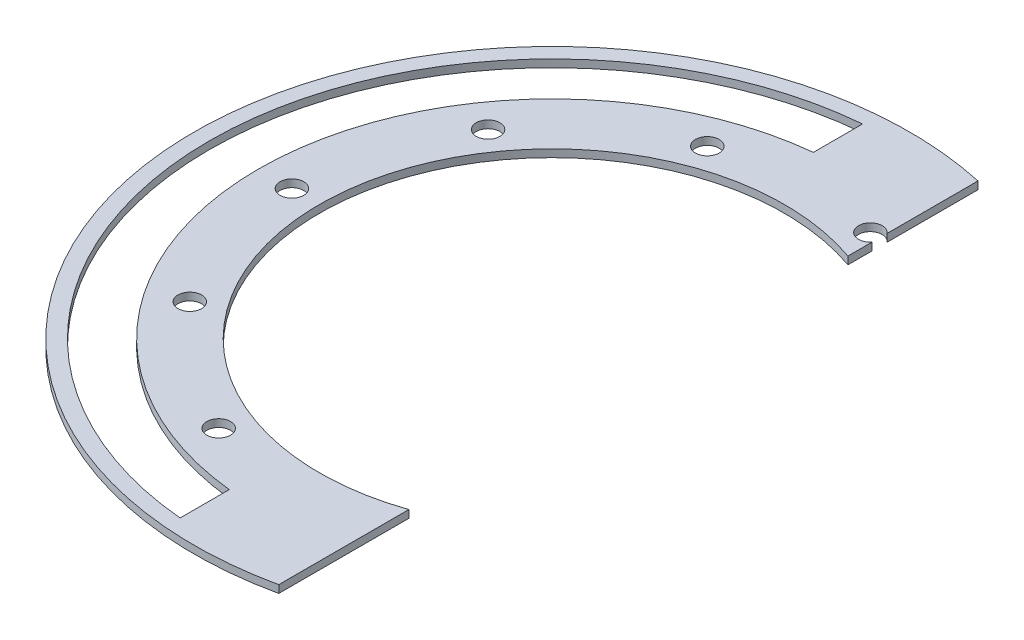
ISO-10303-21;
HEADER;
FILE_DESCRIPTION(('STEP AP214'),'2;1');
FILE_NAME('part.step','',(''),(''),'','','');
FILE_SCHEMA(('AUTOMOTIVE_DESIGN { 1 0 10303 214 1 1 1 1 }'));
ENDSEC;
DATA;
#1=APPLICATION_CONTEXT('core data for automotive mechanical design processes');
#2=APPLICATION_PROTOCOL_DEFINITION('international standard','automotive_design',2000,#1);
#3=PRODUCT_CONTEXT('',#1,'mechanical');
#4=PRODUCT('Part','Part','',(#3));
#5=PRODUCT_RELATED_PRODUCT_CATEGORY('part','',(#4));
#6=PRODUCT_DEFINITION_FORMATION('','',#4);
#7=PRODUCT_DEFINITION_CONTEXT('part definition',#1,'design');
#8=PRODUCT_DEFINITION('design','',#6,#7);
#9=PRODUCT_DEFINITION_SHAPE('','',#8);
#10=(LENGTH_UNIT() NAMED_UNIT(*) SI_UNIT(.MILLI.,.METRE.));
#11=(NAMED_UNIT(*) PLANE_ANGLE_UNIT() SI_UNIT($,.RADIAN.));
#12=(NAMED_UNIT(*) SI_UNIT($,.STERADIAN.) SOLID_ANGLE_UNIT());
#13=UNCERTAINTY_MEASURE_WITH_UNIT(LENGTH_MEASURE(1.E-05),#10,'distance_accuracy_value','');
#14=(GEOMETRIC_REPRESENTATION_CONTEXT(3) GLOBAL_UNCERTAINTY_ASSIGNED_CONTEXT((#13)) GLOBAL_UNIT_ASSIGNED_CONTEXT((#10,
#11,#12)) REPRESENTATION_CONTEXT('',''));
#15=CARTESIAN_POINT('',(0.,0.,0.));
#16=DIRECTION('',(0.,0.,1.));
#17=DIRECTION('',(1.,0.,0.));
#18=AXIS2_PLACEMENT_3D('',#15,#16,#17);
#19=CARTESIAN_POINT('',(15.8750000000001,-1.74625,0.));
#20=DIRECTION('',(-1.,0.,0.));
#21=DIRECTION('',(0.,0.,1.));
#22=AXIS2_PLACEMENT_3D('',#19,#20,#21);
#23=PLANE('',#22);
#24=DIRECTION('',(0.,0.,1.));
#25=VECTOR('',#24,1.);
#26=CARTESIAN_POINT('',(15.8750000000002,-0.79375,152.4));
#27=LINE('',#26,#25);
#28=CARTESIAN_POINT('',(15.875,-0.79375,-50.5837146273416));
#29=VERTEX_POINT('',#28);
#30=CARTESIAN_POINT('',(15.875,-0.79375,-45.5742468396352));
#31=VERTEX_POINT('',#30);
#32=EDGE_CURVE('E130',#29,#31,#27,.T.);
#33=ORIENTED_EDGE('',*,*,#32,.F.);
#34=DIRECTION('',(0.,1.,0.));
#35=VECTOR('',#34,1.);
#36=CARTESIAN_POINT('',(15.875,0.79375,-50.5837146273415));
#37=LINE('',#36,#35);
#38=CARTESIAN_POINT('',(15.875,0.793750000000001,-50.5837146273416));
#39=VERTEX_POINT('',#38);
#40=EDGE_CURVE('E124',#29,#39,#37,.T.);
#41=ORIENTED_EDGE('',*,*,#40,.T.);
#42=DIRECTION('',(0.,0.,1.));
#43=VECTOR('',#42,1.);
#44=CARTESIAN_POINT('',(15.8750000000001,0.79375,0.));
#45=LINE('',#44,#43);
#46=CARTESIAN_POINT('',(15.875,0.79375,-45.5742468396352));
#47=VERTEX_POINT('',#46);
#48=EDGE_CURVE('E236',#39,#47,#45,.T.);
#49=ORIENTED_EDGE('',*,*,#48,.T.);
#50=DIRECTION('',(0.,1.,0.));
#51=VECTOR('',#50,1.);
#52=CARTESIAN_POINT('',(15.875,-1.74625,-45.5742468396352));
#53=LINE('',#52,#51);
#54=EDGE_CURVE('E227',#31,#47,#53,.T.);
#55=ORIENTED_EDGE('',*,*,#54,.F.);
#56=EDGE_LOOP('',(#33,#41,#49,#55));
#57=FACE_BOUND('',#56,.T.);
#58=ADVANCED_FACE('F108',(#57),#23,.F.);
#59=CARTESIAN_POINT('',(152.4,0.79375,152.4));
#60=DIRECTION('',(0.,-1.,0.));
#61=DIRECTION('',(0.,0.,-1.));
#62=AXIS2_PLACEMENT_3D('',#59,#60,#61);
#63=PLANE('',#62);
#64=CARTESIAN_POINT('',(-18.4605372360028,0.793750000000001,50.7199092069195));
#65=DIRECTION('',(0.,1.,0.));
#66=DIRECTION('',(0.,0.,1.));
#67=AXIS2_PLACEMENT_3D('',#64,#65,#66);
#68=CIRCLE('',#67,2.45744999999999);
#69=CARTESIAN_POINT('',(-18.4605372360028,0.793750000000001,53.1773592069194));
#70=VERTEX_POINT('',#69);
#71=EDGE_CURVE('E452',#70,#70,#68,.T.);
#72=ORIENTED_EDGE('',*,*,#71,.F.);
#73=EDGE_LOOP('',(#72));
#74=FACE_BOUND('',#73,.T.);
#75=CARTESIAN_POINT('',(-44.2137315904983,0.793750000000001,30.9587881520478));
#76=DIRECTION('',(0.,1.,0.));
#77=DIRECTION('',(0.,0.,1.));
#78=AXIS2_PLACEMENT_3D('',#75,#76,#77);
#79=CIRCLE('',#78,2.45744999999999);
#80=CARTESIAN_POINT('',(-44.2137315904983,0.793750000000001,33.4162381520478));
#81=VERTEX_POINT('',#80);
#82=EDGE_CURVE('E454',#81,#81,#79,.T.);
#83=ORIENTED_EDGE('',*,*,#82,.F.);
#84=EDGE_LOOP('',(#83));
#85=FACE_BOUND('',#84,.T.);
#86=CARTESIAN_POINT('',(-18.4605372360028,0.793750000000001,-50.7199092069195));
#87=DIRECTION('',(0.,1.,0.));
#88=DIRECTION('',(0.,0.,1.));
#89=AXIS2_PLACEMENT_3D('',#86,#87,#88);
#90=CIRCLE('',#89,2.45744999999999);
#91=CARTESIAN_POINT('',(-18.4605372360028,0.793750000000001,-48.2624592069195));
#92=VERTEX_POINT('',#91);
#93=EDGE_CURVE('E464',#92,#92,#90,.T.);
#94=ORIENTED_EDGE('',*,*,#93,.F.);
#95=EDGE_LOOP('',(#94));
#96=FACE_BOUND('',#95,.T.);
#97=CARTESIAN_POINT('',(-44.2137315904983,0.793750000000001,-30.9587881520478));
#98=DIRECTION('',(0.,1.,0.));
#99=DIRECTION('',(0.,0.,1.));
#100=AXIS2_PLACEMENT_3D('',#97,#98,#99);
#101=CIRCLE('',#100,2.45744999999999);
#102=CARTESIAN_POINT('',(-44.2137315904983,0.793750000000001,-28.5013381520478));
#103=VERTEX_POINT('',#102);
#104=EDGE_CURVE('E470',#103,#103,#101,.T.);
#105=ORIENTED_EDGE('',*,*,#104,.F.);
#106=EDGE_LOOP('',(#105));
#107=FACE_BOUND('',#106,.T.);
#108=CARTESIAN_POINT('',(-53.975,0.793750000000001,0.));
#109=DIRECTION('',(0.,1.,0.));
#110=DIRECTION('',(0.,0.,1.));
#111=AXIS2_PLACEMENT_3D('',#108,#109,#110);
#112=CIRCLE('',#111,2.45744999999999);
#113=CARTESIAN_POINT('',(-53.975,0.793750000000001,2.45744999999998));
#114=VERTEX_POINT('',#113);
#115=EDGE_CURVE('E476',#114,#114,#112,.T.);
#116=ORIENTED_EDGE('',*,*,#115,.F.);
#117=EDGE_LOOP('',(#116));
#118=FACE_BOUND('',#117,.T.);
#119=DIRECTION('',(0.,0.,1.));
#120=VECTOR('',#119,1.);
#121=CARTESIAN_POINT('',(-6.35,0.79375,0.));
#122=LINE('',#121,#120);
#123=CARTESIAN_POINT('',(-6.34999999999999,0.79375,60.6283687723825));
#124=VERTEX_POINT('',#123);
#125=CARTESIAN_POINT('',(-6.34999999999999,0.79375,70.8359506183125));
#126=VERTEX_POINT('',#125);
#127=EDGE_CURVE('E249',#124,#126,#122,.T.);
#128=ORIENTED_EDGE('',*,*,#127,.T.);
#129=CARTESIAN_POINT('',(0.,0.79375,0.));
#130=DIRECTION('',(0.,1.,0.));
#131=DIRECTION('',(0.,0.,1.));
#132=AXIS2_PLACEMENT_3D('',#129,#130,#131);
#133=CIRCLE('',#132,71.12);
#134=CARTESIAN_POINT('',(-6.34999999999999,0.79375,-70.8359506183125));
#135=VERTEX_POINT('',#134);
#136=EDGE_CURVE('E246',#135,#126,#133,.T.);
#137=ORIENTED_EDGE('',*,*,#136,.F.);
#138=DIRECTION('',(0.,0.,1.));
#139=VECTOR('',#138,1.);
#140=CARTESIAN_POINT('',(-6.35,0.79375,0.));
#141=LINE('',#140,#139);
#142=CARTESIAN_POINT('',(-6.34999999999999,0.79375,-60.6283687723825));
#143=VERTEX_POINT('',#142);
#144=EDGE_CURVE('E243',#135,#143,#141,.T.);
#145=ORIENTED_EDGE('',*,*,#144,.T.);
#146=CARTESIAN_POINT('',(0.,0.79375,0.));
#147=DIRECTION('',(0.,1.,0.));
#148=DIRECTION('',(0.,0.,1.));
#149=AXIS2_PLACEMENT_3D('',#146,#147,#148);
#150=CIRCLE('',#149,60.96);
#151=EDGE_CURVE('E240',#143,#124,#150,.T.);
#152=ORIENTED_EDGE('',*,*,#151,.T.);
#153=EDGE_LOOP('',(#128,#137,#145,#152));
#154=FACE_BOUND('',#153,.T.);
#155=ORIENTED_EDGE('',*,*,#48,.F.);
#156=CARTESIAN_POINT('',(13.9697579594088,0.793750000000001,-52.1358464739524));
#157=DIRECTION('',(0.,1.,0.));
#158=DIRECTION('',(0.,0.,1.));
#159=AXIS2_PLACEMENT_3D('',#156,#157,#158);
#160=CIRCLE('',#159,2.45744999999999);
#161=CARTESIAN_POINT('',(15.875,0.793750000000001,-53.6879783205633));
#162=VERTEX_POINT('',#161);
#163=EDGE_CURVE('E196',#162,#39,#160,.T.);
#164=ORIENTED_EDGE('',*,*,#163,.F.);
#165=CARTESIAN_POINT('',(15.875,0.79375,-72.5791388761261));
#166=VERTEX_POINT('',#165);
#167=EDGE_CURVE('E195',#166,#162,#45,.T.);
#168=ORIENTED_EDGE('',*,*,#167,.F.);
#169=CARTESIAN_POINT('',(0.,0.79375,0.));
#170=DIRECTION('',(0.,1.,0.));
#171=DIRECTION('',(0.,0.,1.));
#172=AXIS2_PLACEMENT_3D('',#169,#170,#171);
#173=CIRCLE('',#172,74.295);
#174=CARTESIAN_POINT('',(15.875,0.79375,72.5791388761261));
#175=VERTEX_POINT('',#174);
#176=EDGE_CURVE('E238',#166,#175,#173,.T.);
#177=ORIENTED_EDGE('',*,*,#176,.T.);
#178=DIRECTION('',(0.,0.,-1.));
#179=VECTOR('',#178,1.);
#180=CARTESIAN_POINT('',(15.8750000000001,0.79375,0.));
#181=LINE('',#180,#179);
#182=CARTESIAN_POINT('',(15.875,0.79375,45.5742468396352));
#183=VERTEX_POINT('',#182);
#184=EDGE_CURVE('E217',#175,#183,#181,.T.);
#185=ORIENTED_EDGE('',*,*,#184,.T.);
#186=CARTESIAN_POINT('',(0.,0.79375,0.));
#187=DIRECTION('',(0.,1.,0.));
#188=DIRECTION('',(0.,0.,1.));
#189=AXIS2_PLACEMENT_3D('',#186,#187,#188);
#190=CIRCLE('',#189,48.26);
#191=EDGE_CURVE('E229',#47,#183,#190,.T.);
#192=ORIENTED_EDGE('',*,*,#191,.F.);
#193=EDGE_LOOP('',(#155,#164,#168,#177,#185,#192));
#194=FACE_BOUND('',#193,.T.);
#195=ADVANCED_FACE('F281',(#74,#85,#96,#107,#118,#154,#194),#63,.F.);
#196=CARTESIAN_POINT('',(-6.35,-1.74625,0.));
#197=DIRECTION('',(-1.,0.,0.));
#198=DIRECTION('',(0.,0.,1.));
#199=AXIS2_PLACEMENT_3D('',#196,#197,#198);
#200=PLANE('',#199);
#201=DIRECTION('',(0.,0.,1.));
#202=VECTOR('',#201,1.);
#203=CARTESIAN_POINT('',(-6.34999999999997,-0.79375,152.4));
#204=LINE('',#203,#202);
#205=CARTESIAN_POINT('',(-6.34999999999999,-0.79375,60.6283687723825));
#206=VERTEX_POINT('',#205);
#207=CARTESIAN_POINT('',(-6.34999999999999,-0.79375,70.8359506183125));
#208=VERTEX_POINT('',#207);
#209=EDGE_CURVE('E204',#206,#208,#204,.T.);
#210=ORIENTED_EDGE('',*,*,#209,.T.);
#211=DIRECTION('',(0.,1.,0.));
#212=VECTOR('',#211,1.);
#213=CARTESIAN_POINT('',(-6.34999999999999,-1.74625,70.8359506183125));
#214=LINE('',#213,#212);
#215=EDGE_CURVE('E257',#208,#126,#214,.T.);
#216=ORIENTED_EDGE('',*,*,#215,.T.);
#217=ORIENTED_EDGE('',*,*,#127,.F.);
#218=DIRECTION('',(0.,1.,0.));
#219=VECTOR('',#218,1.);
#220=CARTESIAN_POINT('',(-6.34999999999999,-1.74625,60.6283687723825));
#221=LINE('',#220,#219);
#222=EDGE_CURVE('E253',#206,#124,#221,.T.);
#223=ORIENTED_EDGE('',*,*,#222,.F.);
#224=EDGE_LOOP('',(#210,#216,#217,#223));
#225=FACE_BOUND('',#224,.T.);
#226=ADVANCED_FACE('F273',(#225),#200,.T.);
#227=CARTESIAN_POINT('',(0.,-1.74625,0.));
#228=DIRECTION('',(0.,1.,0.));
#229=DIRECTION('',(0.,0.,1.));
#230=AXIS2_PLACEMENT_3D('',#227,#228,#229);
#231=CYLINDRICAL_SURFACE('',#230,71.12);
#232=DIRECTION('',(0.,1.,0.));
#233=VECTOR('',#232,1.);
#234=CARTESIAN_POINT('',(-6.34999999999999,-1.74625,-70.8359506183125));
#235=LINE('',#234,#233);
#236=CARTESIAN_POINT('',(-6.34999999999999,-0.79375,-70.8359506183125));
#237=VERTEX_POINT('',#236);
#238=EDGE_CURVE('E259',#237,#135,#235,.T.);
#239=ORIENTED_EDGE('',*,*,#238,.T.);
#240=ORIENTED_EDGE('',*,*,#136,.T.);
#241=ORIENTED_EDGE('',*,*,#215,.F.);
#242=CARTESIAN_POINT('',(0.,-0.79375,0.));
#243=DIRECTION('',(0.,1.,0.));
#244=DIRECTION('',(0.,0.,1.));
#245=AXIS2_PLACEMENT_3D('',#242,#243,#244);
#246=CIRCLE('',#245,71.12);
#247=EDGE_CURVE('E265',#237,#208,#246,.T.);
#248=ORIENTED_EDGE('',*,*,#247,.F.);
#249=EDGE_LOOP('',(#239,#240,#241,#248));
#250=FACE_BOUND('',#249,.T.);
#251=ADVANCED_FACE('F276',(#250),#231,.F.);
#252=CARTESIAN_POINT('',(-6.35,-1.74625,0.));
#253=DIRECTION('',(-1.,0.,0.));
#254=DIRECTION('',(0.,0.,1.));
#255=AXIS2_PLACEMENT_3D('',#252,#253,#254);
#256=PLANE('',#255);
#257=DIRECTION('',(0.,0.,1.));
#258=VECTOR('',#257,1.);
#259=CARTESIAN_POINT('',(-6.35000000000002,-0.79375,152.4));
#260=LINE('',#259,#258);
#261=CARTESIAN_POINT('',(-6.34999999999999,-0.79375,-60.6283687723825));
#262=VERTEX_POINT('',#261);
#263=EDGE_CURVE('E263',#237,#262,#260,.T.);
#264=ORIENTED_EDGE('',*,*,#263,.T.);
#265=DIRECTION('',(0.,1.,0.));
#266=VECTOR('',#265,1.);
#267=CARTESIAN_POINT('',(-6.34999999999999,-1.74625,-60.6283687723825));
#268=LINE('',#267,#266);
#269=EDGE_CURVE('E252',#262,#143,#268,.T.);
#270=ORIENTED_EDGE('',*,*,#269,.T.);
#271=ORIENTED_EDGE('',*,*,#144,.F.);
#272=ORIENTED_EDGE('',*,*,#238,.F.);
#273=EDGE_LOOP('',(#264,#270,#271,#272));
#274=FACE_BOUND('',#273,.T.);
#275=ADVANCED_FACE('F287',(#274),#256,.T.);
#276=CARTESIAN_POINT('',(0.,-1.74625,0.));
#277=DIRECTION('',(0.,1.,0.));
#278=DIRECTION('',(0.,0.,1.));
#279=AXIS2_PLACEMENT_3D('',#276,#277,#278);
#280=CYLINDRICAL_SURFACE('',#279,60.96);
#281=CARTESIAN_POINT('',(0.,-0.79375,0.));
#282=DIRECTION('',(0.,1.,0.));
#283=DIRECTION('',(0.,0.,1.));
#284=AXIS2_PLACEMENT_3D('',#281,#282,#283);
#285=CIRCLE('',#284,60.96);
#286=EDGE_CURVE('E256',#262,#206,#285,.T.);
#287=ORIENTED_EDGE('',*,*,#286,.T.);
#288=ORIENTED_EDGE('',*,*,#222,.T.);
#289=ORIENTED_EDGE('',*,*,#151,.F.);
#290=ORIENTED_EDGE('',*,*,#269,.F.);
#291=EDGE_LOOP('',(#287,#288,#289,#290));
#292=FACE_BOUND('',#291,.T.);
#293=ADVANCED_FACE('F285',(#292),#280,.T.);
#294=CARTESIAN_POINT('',(0.,-1.74625,0.));
#295=DIRECTION('',(0.,1.,0.));
#296=DIRECTION('',(0.,0.,1.));
#297=AXIS2_PLACEMENT_3D('',#294,#295,#296);
#298=CYLINDRICAL_SURFACE('',#297,74.295);
#299=CARTESIAN_POINT('',(0.,-0.79375,0.));
#300=DIRECTION('',(0.,1.,0.));
#301=DIRECTION('',(0.,0.,1.));
#302=AXIS2_PLACEMENT_3D('',#299,#300,#301);
#303=CIRCLE('',#302,74.295);
#304=CARTESIAN_POINT('',(15.875,-0.79375,-72.5791388761261));
#305=VERTEX_POINT('',#304);
#306=CARTESIAN_POINT('',(15.875,-0.79375,72.5791388761261));
#307=VERTEX_POINT('',#306);
#308=EDGE_CURVE('E112',#305,#307,#303,.T.);
#309=ORIENTED_EDGE('',*,*,#308,.T.);
#310=DIRECTION('',(0.,1.,0.));
#311=VECTOR('',#310,1.);
#312=CARTESIAN_POINT('',(15.875,-1.74625,72.5791388761261));
#313=LINE('',#312,#311);
#314=EDGE_CURVE('E212',#307,#175,#313,.T.);
#315=ORIENTED_EDGE('',*,*,#314,.T.);
#316=ORIENTED_EDGE('',*,*,#176,.F.);
#317=DIRECTION('',(0.,1.,0.));
#318=VECTOR('',#317,1.);
#319=CARTESIAN_POINT('',(15.875,-1.74625,-72.5791388761261));
#320=LINE('',#319,#318);
#321=EDGE_CURVE('E214',#305,#166,#320,.T.);
#322=ORIENTED_EDGE('',*,*,#321,.F.);
#323=EDGE_LOOP('',(#309,#315,#316,#322));
#324=FACE_BOUND('',#323,.T.);
#325=ADVANCED_FACE('F211',(#324),#298,.T.);
#326=CARTESIAN_POINT('',(15.8750000000001,-1.74625,0.));
#327=DIRECTION('',(1.,0.,0.));
#328=DIRECTION('',(0.,0.,-1.));
#329=AXIS2_PLACEMENT_3D('',#326,#327,#328);
#330=PLANE('',#329);
#331=DIRECTION('',(0.,0.,-1.));
#332=VECTOR('',#331,1.);
#333=CARTESIAN_POINT('',(15.8749999999999,-0.79375,152.4));
#334=LINE('',#333,#332);
#335=CARTESIAN_POINT('',(15.875,-0.79375,45.5742468396352));
#336=VERTEX_POINT('',#335);
#337=EDGE_CURVE('E202',#307,#336,#334,.T.);
#338=ORIENTED_EDGE('',*,*,#337,.T.);
#339=DIRECTION('',(0.,1.,0.));
#340=VECTOR('',#339,1.);
#341=CARTESIAN_POINT('',(15.875,-1.74625,45.5742468396352));
#342=LINE('',#341,#340);
#343=EDGE_CURVE('E219',#336,#183,#342,.T.);
#344=ORIENTED_EDGE('',*,*,#343,.T.);
#345=ORIENTED_EDGE('',*,*,#184,.F.);
#346=ORIENTED_EDGE('',*,*,#314,.F.);
#347=EDGE_LOOP('',(#338,#344,#345,#346));
#348=FACE_BOUND('',#347,.T.);
#349=ADVANCED_FACE('F215',(#348),#330,.T.);
#350=CARTESIAN_POINT('',(0.,-1.74625,0.));
#351=DIRECTION('',(0.,1.,0.));
#352=DIRECTION('',(0.,0.,1.));
#353=AXIS2_PLACEMENT_3D('',#350,#351,#352);
#354=CYLINDRICAL_SURFACE('',#353,48.26);
#355=ORIENTED_EDGE('',*,*,#54,.T.);
#356=ORIENTED_EDGE('',*,*,#191,.T.);
#357=ORIENTED_EDGE('',*,*,#343,.F.);
#358=CARTESIAN_POINT('',(0.,-0.79375,0.));
#359=DIRECTION('',(0.,1.,0.));
#360=DIRECTION('',(0.,0.,1.));
#361=AXIS2_PLACEMENT_3D('',#358,#359,#360);
#362=CIRCLE('',#361,48.26);
#363=EDGE_CURVE('E200',#31,#336,#362,.T.);
#364=ORIENTED_EDGE('',*,*,#363,.F.);
#365=EDGE_LOOP('',(#355,#356,#357,#364));
#366=FACE_BOUND('',#365,.T.);
#367=ADVANCED_FACE('F225',(#366),#354,.F.);
#368=ORIENTED_EDGE('',*,*,#167,.T.);
#369=DIRECTION('',(0.,1.,0.));
#370=VECTOR('',#369,1.);
#371=CARTESIAN_POINT('',(15.875,0.79375,-53.6879783205633));
#372=LINE('',#371,#370);
#373=CARTESIAN_POINT('',(15.875,-0.79375,-53.6879783205633));
#374=VERTEX_POINT('',#373);
#375=EDGE_CURVE('E185',#162,#374,#372,.F.);
#376=ORIENTED_EDGE('',*,*,#375,.T.);
#377=EDGE_CURVE('E192',#305,#374,#27,.T.);
#378=ORIENTED_EDGE('',*,*,#377,.F.);
#379=ORIENTED_EDGE('',*,*,#321,.T.);
#380=EDGE_LOOP('',(#368,#376,#378,#379));
#381=FACE_BOUND('',#380,.T.);
#382=ADVANCED_FACE('F190',(#381),#23,.F.);
#383=CARTESIAN_POINT('',(152.4,-0.79375,152.4));
#384=DIRECTION('',(0.,1.,0.));
#385=DIRECTION('',(0.,0.,1.));
#386=AXIS2_PLACEMENT_3D('',#383,#384,#385);
#387=PLANE('',#386);
#388=CARTESIAN_POINT('',(-18.4605372360028,-0.79375,50.7199092069195));
#389=DIRECTION('',(0.,1.,0.));
#390=DIRECTION('',(0.,0.,1.));
#391=AXIS2_PLACEMENT_3D('',#388,#389,#390);
#392=CIRCLE('',#391,2.45745);
#393=CARTESIAN_POINT('',(-18.4605372360028,-0.79375,53.1773592069195));
#394=VERTEX_POINT('',#393);
#395=EDGE_CURVE('E449',#394,#394,#392,.T.);
#396=ORIENTED_EDGE('',*,*,#395,.T.);
#397=EDGE_LOOP('',(#396));
#398=FACE_BOUND('',#397,.T.);
#399=CARTESIAN_POINT('',(-44.2137315904983,-0.79375,30.9587881520478));
#400=DIRECTION('',(0.,1.,0.));
#401=DIRECTION('',(0.,0.,1.));
#402=AXIS2_PLACEMENT_3D('',#399,#400,#401);
#403=CIRCLE('',#402,2.45745);
#404=CARTESIAN_POINT('',(-44.2137315904983,-0.79375,33.4162381520478));
#405=VERTEX_POINT('',#404);
#406=EDGE_CURVE('E459',#405,#405,#403,.T.);
#407=ORIENTED_EDGE('',*,*,#406,.T.);
#408=EDGE_LOOP('',(#407));
#409=FACE_BOUND('',#408,.T.);
#410=CARTESIAN_POINT('',(-18.4605372360028,-0.79375,-50.7199092069195));
#411=DIRECTION('',(0.,1.,0.));
#412=DIRECTION('',(0.,0.,1.));
#413=AXIS2_PLACEMENT_3D('',#410,#411,#412);
#414=CIRCLE('',#413,2.45745);
#415=CARTESIAN_POINT('',(-18.4605372360028,-0.79375,-48.2624592069195));
#416=VERTEX_POINT('',#415);
#417=EDGE_CURVE('E467',#416,#416,#414,.T.);
#418=ORIENTED_EDGE('',*,*,#417,.T.);
#419=EDGE_LOOP('',(#418));
#420=FACE_BOUND('',#419,.T.);
#421=CARTESIAN_POINT('',(-44.2137315904983,-0.79375,-30.9587881520478));
#422=DIRECTION('',(0.,1.,0.));
#423=DIRECTION('',(0.,0.,1.));
#424=AXIS2_PLACEMENT_3D('',#421,#422,#423);
#425=CIRCLE('',#424,2.45745);
#426=CARTESIAN_POINT('',(-44.2137315904983,-0.79375,-28.5013381520478));
#427=VERTEX_POINT('',#426);
#428=EDGE_CURVE('E473',#427,#427,#425,.T.);
#429=ORIENTED_EDGE('',*,*,#428,.T.);
#430=EDGE_LOOP('',(#429));
#431=FACE_BOUND('',#430,.T.);
#432=CARTESIAN_POINT('',(-53.975,-0.79375,0.));
#433=DIRECTION('',(0.,1.,0.));
#434=DIRECTION('',(0.,0.,1.));
#435=AXIS2_PLACEMENT_3D('',#432,#433,#434);
#436=CIRCLE('',#435,2.45745);
#437=CARTESIAN_POINT('',(-53.975,-0.79375,2.45745));
#438=VERTEX_POINT('',#437);
#439=EDGE_CURVE('E220',#438,#438,#436,.T.);
#440=ORIENTED_EDGE('',*,*,#439,.T.);
#441=EDGE_LOOP('',(#440));
#442=FACE_BOUND('',#441,.T.);
#443=ORIENTED_EDGE('',*,*,#209,.F.);
#444=ORIENTED_EDGE('',*,*,#286,.F.);
#445=ORIENTED_EDGE('',*,*,#263,.F.);
#446=ORIENTED_EDGE('',*,*,#247,.T.);
#447=EDGE_LOOP('',(#443,#444,#445,#446));
#448=FACE_BOUND('',#447,.T.);
#449=ORIENTED_EDGE('',*,*,#377,.T.);
#450=CARTESIAN_POINT('',(13.9697579594088,-0.79375,-52.1358464739524));
#451=DIRECTION('',(0.,1.,0.));
#452=DIRECTION('',(0.,0.,1.));
#453=AXIS2_PLACEMENT_3D('',#450,#451,#452);
#454=CIRCLE('',#453,2.45745);
#455=EDGE_CURVE('E12',#374,#29,#454,.T.);
#456=ORIENTED_EDGE('',*,*,#455,.T.);
#457=ORIENTED_EDGE('',*,*,#32,.T.);
#458=ORIENTED_EDGE('',*,*,#363,.T.);
#459=ORIENTED_EDGE('',*,*,#337,.F.);
#460=ORIENTED_EDGE('',*,*,#308,.F.);
#461=EDGE_LOOP('',(#449,#456,#457,#458,#459,#460));
#462=FACE_BOUND('',#461,.T.);
#463=ADVANCED_FACE('F110',(#398,#409,#420,#431,#442,#448,#462),#387,.F.);
#464=CARTESIAN_POINT('',(-53.975,0.79375,0.));
#465=DIRECTION('',(0.,1.,0.));
#466=DIRECTION('',(0.,0.,1.));
#467=AXIS2_PLACEMENT_3D('',#464,#465,#466);
#468=CYLINDRICAL_SURFACE('',#467,2.45744999999999);
#469=ORIENTED_EDGE('',*,*,#439,.F.);
#470=EDGE_LOOP('',(#469));
#471=FACE_BOUND('',#470,.T.);
#472=ORIENTED_EDGE('',*,*,#115,.T.);
#473=EDGE_LOOP('',(#472));
#474=FACE_BOUND('',#473,.T.);
#475=ADVANCED_FACE('F313',(#471,#474),#468,.F.);
#476=CARTESIAN_POINT('',(-44.2137315904983,0.79375,-30.9587881520478));
#477=DIRECTION('',(0.,1.,0.));
#478=DIRECTION('',(0.,0.,1.));
#479=AXIS2_PLACEMENT_3D('',#476,#477,#478);
#480=CYLINDRICAL_SURFACE('',#479,2.45744999999999);
#481=ORIENTED_EDGE('',*,*,#428,.F.);
#482=EDGE_LOOP('',(#481));
#483=FACE_BOUND('',#482,.T.);
#484=ORIENTED_EDGE('',*,*,#104,.T.);
#485=EDGE_LOOP('',(#484));
#486=FACE_BOUND('',#485,.T.);
#487=ADVANCED_FACE('F367',(#483,#486),#480,.F.);
#488=CARTESIAN_POINT('',(-18.4605372360028,0.79375,-50.7199092069195));
#489=DIRECTION('',(0.,1.,0.));
#490=DIRECTION('',(0.,0.,1.));
#491=AXIS2_PLACEMENT_3D('',#488,#489,#490);
#492=CYLINDRICAL_SURFACE('',#491,2.45744999999999);
#493=ORIENTED_EDGE('',*,*,#417,.F.);
#494=EDGE_LOOP('',(#493));
#495=FACE_BOUND('',#494,.T.);
#496=ORIENTED_EDGE('',*,*,#93,.T.);
#497=EDGE_LOOP('',(#496));
#498=FACE_BOUND('',#497,.T.);
#499=ADVANCED_FACE('F395',(#495,#498),#492,.F.);
#500=CARTESIAN_POINT('',(13.9697579594088,0.79375,-52.1358464739524));
#501=DIRECTION('',(0.,1.,0.));
#502=DIRECTION('',(0.,0.,1.));
#503=AXIS2_PLACEMENT_3D('',#500,#501,#502);
#504=CYLINDRICAL_SURFACE('',#503,2.45744999999999);
#505=ORIENTED_EDGE('',*,*,#455,.F.);
#506=ORIENTED_EDGE('',*,*,#375,.F.);
#507=ORIENTED_EDGE('',*,*,#163,.T.);
#508=ORIENTED_EDGE('',*,*,#40,.F.);
#509=EDGE_LOOP('',(#505,#506,#507,#508));
#510=FACE_BOUND('',#509,.T.);
#511=ADVANCED_FACE('F184',(#510),#504,.F.);
#512=CARTESIAN_POINT('',(-44.2137315904983,0.79375,30.9587881520478));
#513=DIRECTION('',(0.,1.,0.));
#514=DIRECTION('',(0.,0.,1.));
#515=AXIS2_PLACEMENT_3D('',#512,#513,#514);
#516=CYLINDRICAL_SURFACE('',#515,2.45744999999999);
#517=ORIENTED_EDGE('',*,*,#406,.F.);
#518=EDGE_LOOP('',(#517));
#519=FACE_BOUND('',#518,.T.);
#520=ORIENTED_EDGE('',*,*,#82,.T.);
#521=EDGE_LOOP('',(#520));
#522=FACE_BOUND('',#521,.T.);
#523=ADVANCED_FACE('F415',(#519,#522),#516,.F.);
#524=CARTESIAN_POINT('',(-18.4605372360028,0.79375,50.7199092069195));
#525=DIRECTION('',(0.,1.,0.));
#526=DIRECTION('',(0.,0.,1.));
#527=AXIS2_PLACEMENT_3D('',#524,#525,#526);
#528=CYLINDRICAL_SURFACE('',#527,2.45744999999999);
#529=ORIENTED_EDGE('',*,*,#395,.F.);
#530=EDGE_LOOP('',(#529));
#531=FACE_BOUND('',#530,.T.);
#532=ORIENTED_EDGE('',*,*,#71,.T.);
#533=EDGE_LOOP('',(#532));
#534=FACE_BOUND('',#533,.T.);
#535=ADVANCED_FACE('F425',(#531,#534),#528,.F.);
#536=CLOSED_SHELL('',(#58,#195,#226,#251,#275,#293,#325,#349,#367,#382,#463,#475,#487,#499,#511,
#523,#535));
#537=MANIFOLD_SOLID_BREP('B2',#536);
#538=ADVANCED_BREP_SHAPE_REPRESENTATION('',(#18,#537),#14);
#539=SHAPE_DEFINITION_REPRESENTATION(#9,#538);
ENDSEC;
END-ISO-10303-21;
